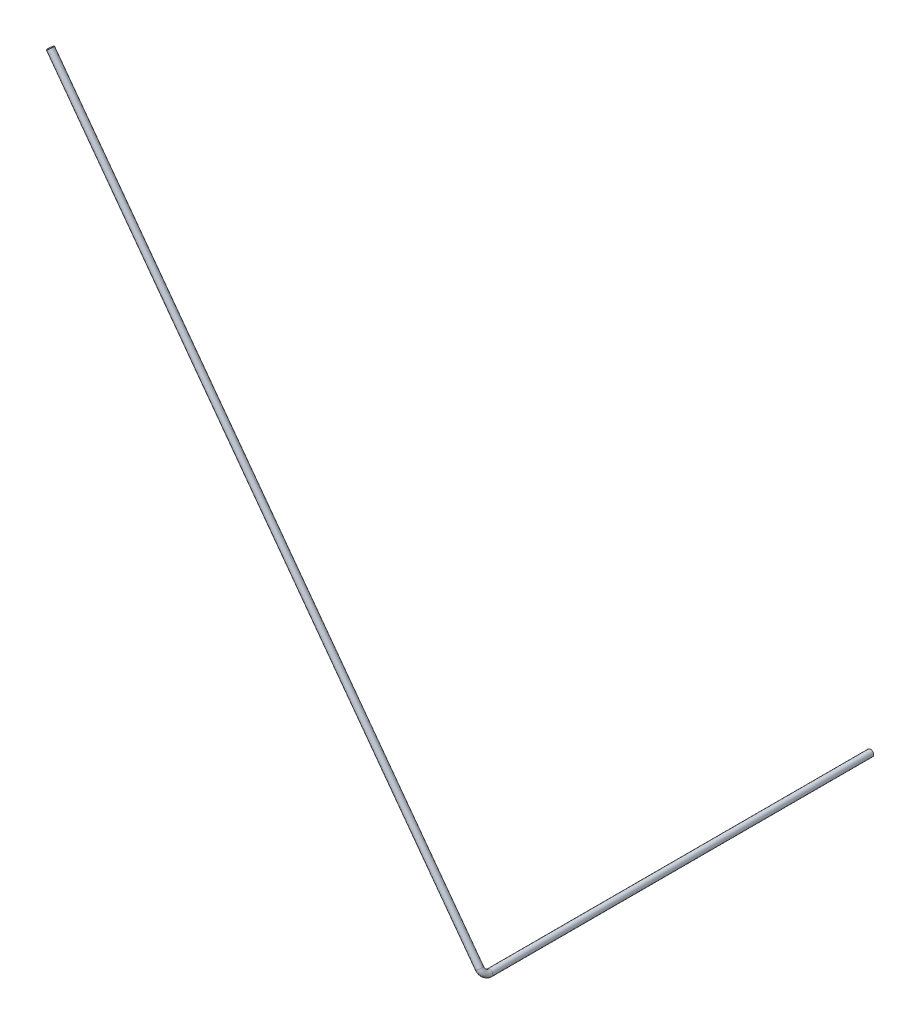
ISO-10303-21;
HEADER;
FILE_DESCRIPTION(('STEP AP214'),'2;1');
FILE_NAME('part.step','',(''),(''),'','','');
FILE_SCHEMA(('AUTOMOTIVE_DESIGN { 1 0 10303 214 1 1 1 1 }'));
ENDSEC;
DATA;
#1=APPLICATION_CONTEXT('core data for automotive mechanical design processes');
#2=APPLICATION_PROTOCOL_DEFINITION('international standard','automotive_design',2000,#1);
#3=PRODUCT_CONTEXT('',#1,'mechanical');
#4=PRODUCT('Part','Part','',(#3));
#5=PRODUCT_RELATED_PRODUCT_CATEGORY('part','',(#4));
#6=PRODUCT_DEFINITION_FORMATION('','',#4);
#7=PRODUCT_DEFINITION_CONTEXT('part definition',#1,'design');
#8=PRODUCT_DEFINITION('design','',#6,#7);
#9=PRODUCT_DEFINITION_SHAPE('','',#8);
#10=(LENGTH_UNIT() NAMED_UNIT(*) SI_UNIT(.MILLI.,.METRE.));
#11=(NAMED_UNIT(*) PLANE_ANGLE_UNIT() SI_UNIT($,.RADIAN.));
#12=(NAMED_UNIT(*) SI_UNIT($,.STERADIAN.) SOLID_ANGLE_UNIT());
#13=UNCERTAINTY_MEASURE_WITH_UNIT(LENGTH_MEASURE(1.E-05),#10,'distance_accuracy_value','');
#14=(GEOMETRIC_REPRESENTATION_CONTEXT(3) GLOBAL_UNCERTAINTY_ASSIGNED_CONTEXT((#13)) GLOBAL_UNIT_ASSIGNED_CONTEXT((#10,
#11,#12)) REPRESENTATION_CONTEXT('',''));
#15=CARTESIAN_POINT('',(0.,0.,0.));
#16=DIRECTION('',(0.,0.,1.));
#17=DIRECTION('',(1.,0.,0.));
#18=AXIS2_PLACEMENT_3D('',#15,#16,#17);
#19=CARTESIAN_POINT('',(-31046.0335157072,-16820.5926203562,41171.211472117));
#20=DIRECTION('',(0.,0.,-1.));
#21=DIRECTION('',(0.805116799300295,0.593116295075805,0.));
#22=AXIS2_PLACEMENT_3D('',#19,#20,#21);
#23=PLANE('',#22);
#24=CARTESIAN_POINT('',(-31046.0335157072,-16820.5926203562,41171.211472117));
#25=DIRECTION('',(0.,0.,-1.));
#26=DIRECTION('',(-1.,0.,0.));
#27=AXIS2_PLACEMENT_3D('',#24,#25,#26);
#28=CIRCLE('',#27,13.9999999999995);
#29=CARTESIAN_POINT('',(-31060.0335157072,-16820.5926203562,41171.211472117));
#30=VERTEX_POINT('',#29);
#31=EDGE_CURVE('E70',#30,#30,#28,.T.);
#32=ORIENTED_EDGE('',*,*,#31,.F.);
#33=EDGE_LOOP('',(#32));
#34=FACE_BOUND('',#33,.T.);
#35=CARTESIAN_POINT('',(-31046.0335157072,-16820.5926203562,41171.211472117));
#36=DIRECTION('',(0.,0.,-1.));
#37=DIRECTION('',(0.805116799300295,0.593116295075805,0.));
#38=AXIS2_PLACEMENT_3D('',#35,#36,#37);
#39=CIRCLE('',#38,14.9999999999995);
#40=CARTESIAN_POINT('',(-31033.9567637177,-16811.69587593,41171.211472117));
#41=VERTEX_POINT('',#40);
#42=EDGE_CURVE('E61',#41,#41,#39,.T.);
#43=ORIENTED_EDGE('',*,*,#42,.T.);
#44=EDGE_LOOP('',(#43));
#45=FACE_BOUND('',#44,.T.);
#46=ADVANCED_FACE('F47',(#34,#45),#23,.T.);
#47=CARTESIAN_POINT('',(-33088.7507097446,-14047.7368704916,42998.3901960567));
#48=DIRECTION('',(0.593116295075749,-0.805116799300336,0.));
#49=DIRECTION('',(0.805116799300336,0.593116295075749,0.));
#50=AXIS2_PLACEMENT_3D('',#47,#48,#49);
#51=PLANE('',#50);
#52=CARTESIAN_POINT('',(-33088.7507097446,-14047.7368704916,42998.3901960567));
#53=DIRECTION('',(0.593116295075749,-0.805116799300336,0.));
#54=DIRECTION('',(0.805116799300336,0.593116295075749,0.));
#55=AXIS2_PLACEMENT_3D('',#52,#53,#54);
#56=CIRCLE('',#55,13.9999999999995);
#57=CARTESIAN_POINT('',(-33077.4790745544,-14039.4332423605,42998.3901960567));
#58=VERTEX_POINT('',#57);
#59=EDGE_CURVE('E66',#58,#58,#56,.T.);
#60=ORIENTED_EDGE('',*,*,#59,.T.);
#61=EDGE_LOOP('',(#60));
#62=FACE_BOUND('',#61,.T.);
#63=CARTESIAN_POINT('',(-33088.7507097446,-14047.7368704916,42998.3901960567));
#64=DIRECTION('',(0.593116295075749,-0.805116799300336,0.));
#65=DIRECTION('',(0.805116799300336,0.593116295075749,0.));
#66=AXIS2_PLACEMENT_3D('',#63,#64,#65);
#67=CIRCLE('',#66,14.9999999999995);
#68=CARTESIAN_POINT('',(-33076.6739577551,-14038.8401260654,42998.3901960567));
#69=VERTEX_POINT('',#68);
#70=EDGE_CURVE('E11',#69,#69,#67,.T.);
#71=ORIENTED_EDGE('',*,*,#70,.F.);
#72=EDGE_LOOP('',(#71));
#73=FACE_BOUND('',#72,.T.);
#74=ADVANCED_FACE('F90',(#62,#73),#51,.F.);
#75=CARTESIAN_POINT('',(-31046.0335157072,-16820.5926203562,41171.211472117));
#76=DIRECTION('',(0.,0.,1.));
#77=DIRECTION('',(1.,0.,0.));
#78=AXIS2_PLACEMENT_3D('',#75,#76,#77);
#79=CYLINDRICAL_SURFACE('',#78,14.9999999999995);
#80=CARTESIAN_POINT('',(-31046.0335157072,-16820.5926203562,42968.3901960568));
#81=DIRECTION('',(0.,0.,-1.));
#82=DIRECTION('',(0.805116799300295,0.593116295075805,0.));
#83=AXIS2_PLACEMENT_3D('',#80,#81,#82);
#84=CIRCLE('',#83,14.9999999999995);
#85=CARTESIAN_POINT('',(-31037.1367712811,-16832.6693723457,42968.3901960568));
#86=VERTEX_POINT('',#85);
#87=EDGE_CURVE('E57',#86,#86,#84,.T.);
#88=ORIENTED_EDGE('',*,*,#87,.T.);
#89=EDGE_LOOP('',(#88));
#90=FACE_BOUND('',#89,.T.);
#91=ORIENTED_EDGE('',*,*,#42,.F.);
#92=EDGE_LOOP('',(#91));
#93=FACE_BOUND('',#92,.T.);
#94=ADVANCED_FACE('F94',(#90,#93),#79,.T.);
#95=CARTESIAN_POINT('',(-31063.8270045595,-16796.4391163772,42968.3901960568));
#96=DIRECTION('',(-0.805116799300294,-0.593116295075805,0.));
#97=DIRECTION('',(0.593116295075805,-0.805116799300295,0.));
#98=AXIS2_PLACEMENT_3D('',#95,#96,#97);
#99=TOROIDAL_SURFACE('',#98,29.9999999999974,14.9999999999995);
#100=CARTESIAN_POINT('',(-31063.8270045617,-16796.4391163731,42998.3901960564));
#101=DIRECTION('',(0.593116295075749,-0.805116799300336,0.));
#102=DIRECTION('',(0.805116799300336,0.593116295075749,0.));
#103=AXIS2_PLACEMENT_3D('',#100,#101,#102);
#104=CIRCLE('',#103,14.9999999999995);
#105=CARTESIAN_POINT('',(-31063.8270045628,-16796.4391163711,43013.3901960568));
#106=VERTEX_POINT('',#105);
#107=EDGE_CURVE('E53',#106,#106,#104,.T.);
#108=CARTESIAN_POINT('',(-31063.8270045595,-16796.4391163772,42968.3901960568));
#109=DIRECTION('',(-0.805116799300294,-0.593116295075805,0.));
#110=DIRECTION('',(0.593116295075805,-0.805116799300295,0.));
#111=AXIS2_PLACEMENT_3D('',#108,#109,#110);
#112=CIRCLE('',#111,44.9999999999968);
#113=EDGE_CURVE('',#86,#106,#112,.T.);
#114=ORIENTED_EDGE('',*,*,#87,.F.);
#115=ORIENTED_EDGE('',*,*,#107,.T.);
#116=ORIENTED_EDGE('',*,*,#113,.T.);
#117=ORIENTED_EDGE('',*,*,#113,.F.);
#118=EDGE_LOOP('',(#114,#116,#115,#117));
#119=FACE_BOUND('',#118,.T.);
#120=ADVANCED_FACE('F96',(#119),#99,.T.);
#121=CARTESIAN_POINT('',(-31063.8270045595,-16796.4391163772,42998.3901960568));
#122=DIRECTION('',(-0.593116295075747,0.805116799300337,0.));
#123=DIRECTION('',(-0.805116799300337,-0.593116295075747,0.));
#124=AXIS2_PLACEMENT_3D('',#121,#122,#123);
#125=CYLINDRICAL_SURFACE('',#124,14.9999999999995);
#126=ORIENTED_EDGE('',*,*,#70,.T.);
#127=EDGE_LOOP('',(#126));
#128=FACE_BOUND('',#127,.T.);
#129=ORIENTED_EDGE('',*,*,#107,.F.);
#130=EDGE_LOOP('',(#129));
#131=FACE_BOUND('',#130,.T.);
#132=ADVANCED_FACE('F84',(#128,#131),#125,.T.);
#133=CARTESIAN_POINT('',(-31046.0335157072,-16820.5926203562,41171.211472117));
#134=DIRECTION('',(0.,0.,1.));
#135=DIRECTION('',(1.,0.,0.));
#136=AXIS2_PLACEMENT_3D('',#133,#134,#135);
#137=CYLINDRICAL_SURFACE('',#136,13.9999999999995);
#138=CARTESIAN_POINT('',(-31046.0335157072,-16820.5926203562,42968.3901960568));
#139=DIRECTION('',(0.,0.,1.));
#140=DIRECTION('',(1.,0.,0.));
#141=AXIS2_PLACEMENT_3D('',#138,#139,#140);
#142=CIRCLE('',#141,13.9999999999995);
#143=CARTESIAN_POINT('',(-31037.7298875761,-16831.8642555464,42968.3901960568));
#144=VERTEX_POINT('',#143);
#145=EDGE_CURVE('E73',#144,#144,#142,.F.);
#146=ORIENTED_EDGE('',*,*,#145,.F.);
#147=EDGE_LOOP('',(#146));
#148=FACE_BOUND('',#147,.T.);
#149=ORIENTED_EDGE('',*,*,#31,.T.);
#150=EDGE_LOOP('',(#149));
#151=FACE_BOUND('',#150,.T.);
#152=ADVANCED_FACE('F81',(#148,#151),#137,.F.);
#153=CARTESIAN_POINT('',(-31063.8270045595,-16796.4391163772,42968.3901960568));
#154=DIRECTION('',(-0.805116799300294,-0.593116295075805,0.));
#155=DIRECTION('',(0.593116295075805,-0.805116799300295,0.));
#156=AXIS2_PLACEMENT_3D('',#153,#154,#155);
#157=TOROIDAL_SURFACE('',#156,29.9999999999974,13.9999999999995);
#158=CARTESIAN_POINT('',(-31063.8270045622,-16796.4391163735,42998.3901960568));
#159=DIRECTION('',(-0.593116295075747,0.805116799300337,0.));
#160=DIRECTION('',(-0.805116799300337,-0.593116295075747,0.));
#161=AXIS2_PLACEMENT_3D('',#158,#159,#160);
#162=CIRCLE('',#161,13.9999999999995);
#163=CARTESIAN_POINT('',(-31063.8270045634,-16796.4391163718,43012.3901960568));
#164=VERTEX_POINT('',#163);
#165=EDGE_CURVE('E69',#164,#164,#162,.F.);
#166=CARTESIAN_POINT('',(-31063.8270045595,-16796.4391163772,42968.3901960568));
#167=DIRECTION('',(-0.805116799300294,-0.593116295075805,0.));
#168=DIRECTION('',(0.593116295075805,-0.805116799300295,0.));
#169=AXIS2_PLACEMENT_3D('',#166,#167,#168);
#170=CIRCLE('',#169,43.9999999999968);
#171=EDGE_CURVE('',#144,#164,#170,.T.);
#172=ORIENTED_EDGE('',*,*,#145,.T.);
#173=ORIENTED_EDGE('',*,*,#165,.F.);
#174=ORIENTED_EDGE('',*,*,#171,.T.);
#175=ORIENTED_EDGE('',*,*,#171,.F.);
#176=EDGE_LOOP('',(#172,#174,#173,#175));
#177=FACE_BOUND('',#176,.T.);
#178=ADVANCED_FACE('F79',(#177),#157,.F.);
#179=CARTESIAN_POINT('',(-31063.8270045595,-16796.4391163772,42998.3901960568));
#180=DIRECTION('',(-0.593116295075747,0.805116799300337,0.));
#181=DIRECTION('',(-0.805116799300337,-0.593116295075747,0.));
#182=AXIS2_PLACEMENT_3D('',#179,#180,#181);
#183=CYLINDRICAL_SURFACE('',#182,13.9999999999995);
#184=ORIENTED_EDGE('',*,*,#59,.F.);
#185=EDGE_LOOP('',(#184));
#186=FACE_BOUND('',#185,.T.);
#187=ORIENTED_EDGE('',*,*,#165,.T.);
#188=EDGE_LOOP('',(#187));
#189=FACE_BOUND('',#188,.T.);
#190=ADVANCED_FACE('F91',(#186,#189),#183,.F.);
#191=CLOSED_SHELL('',(#46,#74,#94,#120,#132,#152,#178,#190));
#192=MANIFOLD_SOLID_BREP('B2',#191);
#193=ADVANCED_BREP_SHAPE_REPRESENTATION('',(#18,#192),#14);
#194=SHAPE_DEFINITION_REPRESENTATION(#9,#193);
ENDSEC;
END-ISO-10303-21;
